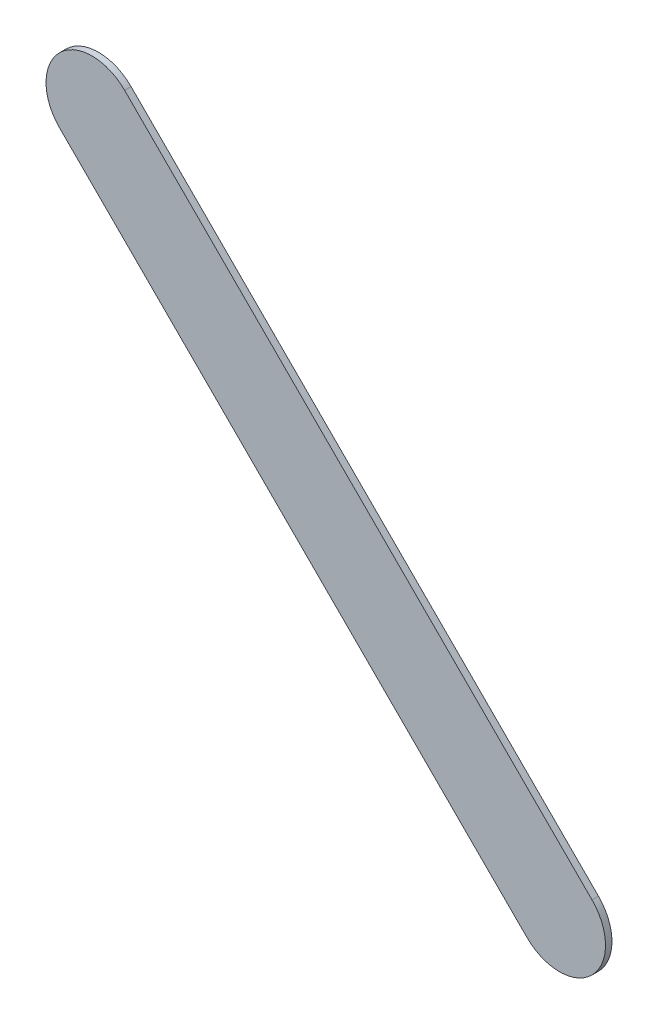
ISO-10303-21;
HEADER;
FILE_DESCRIPTION(('STEP AP214'),'2;1');
FILE_NAME('part.step','',(''),(''),'','','');
FILE_SCHEMA(('AUTOMOTIVE_DESIGN { 1 0 10303 214 1 1 1 1 }'));
ENDSEC;
DATA;
#1=APPLICATION_CONTEXT('core data for automotive mechanical design processes');
#2=APPLICATION_PROTOCOL_DEFINITION('international standard','automotive_design',2000,#1);
#3=PRODUCT_CONTEXT('',#1,'mechanical');
#4=PRODUCT('Part','Part','',(#3));
#5=PRODUCT_RELATED_PRODUCT_CATEGORY('part','',(#4));
#6=PRODUCT_DEFINITION_FORMATION('','',#4);
#7=PRODUCT_DEFINITION_CONTEXT('part definition',#1,'design');
#8=PRODUCT_DEFINITION('design','',#6,#7);
#9=PRODUCT_DEFINITION_SHAPE('','',#8);
#10=(LENGTH_UNIT() NAMED_UNIT(*) SI_UNIT(.MILLI.,.METRE.));
#11=(NAMED_UNIT(*) PLANE_ANGLE_UNIT() SI_UNIT($,.RADIAN.));
#12=(NAMED_UNIT(*) SI_UNIT($,.STERADIAN.) SOLID_ANGLE_UNIT());
#13=UNCERTAINTY_MEASURE_WITH_UNIT(LENGTH_MEASURE(1.E-05),#10,'distance_accuracy_value','');
#14=(GEOMETRIC_REPRESENTATION_CONTEXT(3) GLOBAL_UNCERTAINTY_ASSIGNED_CONTEXT((#13)) GLOBAL_UNIT_ASSIGNED_CONTEXT((#10,
#11,#12)) REPRESENTATION_CONTEXT('',''));
#15=CARTESIAN_POINT('',(0.,0.,0.));
#16=DIRECTION('',(0.,0.,1.));
#17=DIRECTION('',(1.,0.,0.));
#18=AXIS2_PLACEMENT_3D('',#15,#16,#17);
#19=CARTESIAN_POINT('',(162.736776,-85.167223,0.));
#20=DIRECTION('',(0.,0.,1.));
#21=DIRECTION('',(1.,0.,0.));
#22=AXIS2_PLACEMENT_3D('',#19,#20,#21);
#23=PLANE('',#22);
#24=DIRECTION('',(-0.707106781186548,0.707106781186548,0.));
#25=VECTOR('',#24,1.);
#26=CARTESIAN_POINT('',(162.736776,-85.167223,0.));
#27=LINE('',#26,#25);
#28=CARTESIAN_POINT('',(162.736776,-85.167223,0.));
#29=VERTEX_POINT('',#28);
#30=CARTESIAN_POINT('',(160.196776,-82.627223,0.));
#31=VERTEX_POINT('',#30);
#32=EDGE_CURVE('E98',#29,#31,#27,.T.);
#33=ORIENTED_EDGE('',*,*,#32,.T.);
#34=CARTESIAN_POINT('',(160.0199995,-82.8039995,0.));
#35=DIRECTION('',(0.,0.,1.));
#36=DIRECTION('',(0.707106781186548,0.707106781186548,0.));
#37=AXIS2_PLACEMENT_3D('',#34,#35,#36);
#38=CIRCLE('',#37,0.249999723809);
#39=CARTESIAN_POINT('',(159.843223,-82.980776,0.));
#40=VERTEX_POINT('',#39);
#41=EDGE_CURVE('E77',#31,#40,#38,.T.);
#42=ORIENTED_EDGE('',*,*,#41,.T.);
#43=DIRECTION('',(0.707106781186548,-0.707106781186548,0.));
#44=VECTOR('',#43,1.);
#45=CARTESIAN_POINT('',(159.843223,-82.980776,0.));
#46=LINE('',#45,#44);
#47=CARTESIAN_POINT('',(162.383223,-85.520776,0.));
#48=VERTEX_POINT('',#47);
#49=EDGE_CURVE('E82',#40,#48,#46,.T.);
#50=ORIENTED_EDGE('',*,*,#49,.T.);
#51=CARTESIAN_POINT('',(162.5599995,-85.3439995,0.));
#52=DIRECTION('',(0.,0.,1.));
#53=DIRECTION('',(-0.707106781186548,-0.707106781186548,0.));
#54=AXIS2_PLACEMENT_3D('',#51,#52,#53);
#55=CIRCLE('',#54,0.249999723809);
#56=EDGE_CURVE('E11',#48,#29,#55,.T.);
#57=ORIENTED_EDGE('',*,*,#56,.T.);
#58=EDGE_LOOP('',(#33,#42,#50,#57));
#59=FACE_BOUND('',#58,.T.);
#60=ADVANCED_FACE('F17',(#59),#23,.T.);
#61=CARTESIAN_POINT('',(162.736776,-85.167223,-0.035));
#62=DIRECTION('',(0.,0.,1.));
#63=DIRECTION('',(1.,0.,0.));
#64=AXIS2_PLACEMENT_3D('',#61,#62,#63);
#65=PLANE('',#64);
#66=CARTESIAN_POINT('',(162.5599995,-85.3439995,-0.035));
#67=DIRECTION('',(0.,0.,1.));
#68=DIRECTION('',(-0.707106781186548,-0.707106781186548,0.));
#69=AXIS2_PLACEMENT_3D('',#66,#67,#68);
#70=CIRCLE('',#69,0.249999723809);
#71=CARTESIAN_POINT('',(162.383223,-85.520776,-0.035));
#72=VERTEX_POINT('',#71);
#73=CARTESIAN_POINT('',(162.736776,-85.167223,-0.035));
#74=VERTEX_POINT('',#73);
#75=EDGE_CURVE('E25',#72,#74,#70,.T.);
#76=ORIENTED_EDGE('',*,*,#75,.F.);
#77=DIRECTION('',(0.707106781186548,-0.707106781186548,0.));
#78=VECTOR('',#77,1.);
#79=CARTESIAN_POINT('',(159.843223,-82.980776,-0.035));
#80=LINE('',#79,#78);
#81=CARTESIAN_POINT('',(159.843223,-82.980776,-0.035));
#82=VERTEX_POINT('',#81);
#83=EDGE_CURVE('E67',#82,#72,#80,.T.);
#84=ORIENTED_EDGE('',*,*,#83,.F.);
#85=CARTESIAN_POINT('',(160.0199995,-82.8039995,-0.035));
#86=DIRECTION('',(0.,0.,1.));
#87=DIRECTION('',(0.707106781186548,0.707106781186548,0.));
#88=AXIS2_PLACEMENT_3D('',#85,#86,#87);
#89=CIRCLE('',#88,0.249999723809);
#90=CARTESIAN_POINT('',(160.196776,-82.627223,-0.035));
#91=VERTEX_POINT('',#90);
#92=EDGE_CURVE('E71',#91,#82,#89,.T.);
#93=ORIENTED_EDGE('',*,*,#92,.F.);
#94=DIRECTION('',(-0.707106781186548,0.707106781186548,0.));
#95=VECTOR('',#94,1.);
#96=CARTESIAN_POINT('',(162.736776,-85.167223,-0.035));
#97=LINE('',#96,#95);
#98=EDGE_CURVE('E115',#74,#91,#97,.T.);
#99=ORIENTED_EDGE('',*,*,#98,.F.);
#100=EDGE_LOOP('',(#76,#84,#93,#99));
#101=FACE_BOUND('',#100,.T.);
#102=ADVANCED_FACE('F69',(#101),#65,.F.);
#103=CARTESIAN_POINT('',(162.5599995,-85.3439995,-0.035));
#104=DIRECTION('',(0.,0.,-1.));
#105=DIRECTION('',(-0.707106781186548,-0.707106781186548,0.));
#106=AXIS2_PLACEMENT_3D('',#103,#104,#105);
#107=CYLINDRICAL_SURFACE('',#106,0.249999723809);
#108=ORIENTED_EDGE('',*,*,#75,.T.);
#109=DIRECTION('',(0.,0.,1.));
#110=VECTOR('',#109,1.);
#111=CARTESIAN_POINT('',(162.736776,-85.167223,-0.035));
#112=LINE('',#111,#110);
#113=EDGE_CURVE('E92',#74,#29,#112,.T.);
#114=ORIENTED_EDGE('',*,*,#113,.T.);
#115=ORIENTED_EDGE('',*,*,#56,.F.);
#116=DIRECTION('',(0.,0.,1.));
#117=VECTOR('',#116,1.);
#118=CARTESIAN_POINT('',(162.383223,-85.520776,-0.035));
#119=LINE('',#118,#117);
#120=EDGE_CURVE('E76',#72,#48,#119,.T.);
#121=ORIENTED_EDGE('',*,*,#120,.F.);
#122=EDGE_LOOP('',(#108,#114,#115,#121));
#123=FACE_BOUND('',#122,.T.);
#124=ADVANCED_FACE('F108',(#123),#107,.T.);
#125=CARTESIAN_POINT('',(159.843223,-82.980776,-0.035));
#126=DIRECTION('',(0.707106781186548,0.707106781186548,0.));
#127=DIRECTION('',(0.,0.,-1.));
#128=AXIS2_PLACEMENT_3D('',#125,#126,#127);
#129=PLANE('',#128);
#130=ORIENTED_EDGE('',*,*,#83,.T.);
#131=ORIENTED_EDGE('',*,*,#120,.T.);
#132=ORIENTED_EDGE('',*,*,#49,.F.);
#133=DIRECTION('',(0.,0.,1.));
#134=VECTOR('',#133,1.);
#135=CARTESIAN_POINT('',(159.843223,-82.980776,-0.035));
#136=LINE('',#135,#134);
#137=EDGE_CURVE('E80',#82,#40,#136,.T.);
#138=ORIENTED_EDGE('',*,*,#137,.F.);
#139=EDGE_LOOP('',(#130,#131,#132,#138));
#140=FACE_BOUND('',#139,.T.);
#141=ADVANCED_FACE('F81',(#140),#129,.F.);
#142=CARTESIAN_POINT('',(160.0199995,-82.8039995,-0.035));
#143=DIRECTION('',(0.,0.,-1.));
#144=DIRECTION('',(0.707106781186548,0.707106781186548,0.));
#145=AXIS2_PLACEMENT_3D('',#142,#143,#144);
#146=CYLINDRICAL_SURFACE('',#145,0.249999723809);
#147=ORIENTED_EDGE('',*,*,#92,.T.);
#148=ORIENTED_EDGE('',*,*,#137,.T.);
#149=ORIENTED_EDGE('',*,*,#41,.F.);
#150=DIRECTION('',(0.,0.,1.));
#151=VECTOR('',#150,1.);
#152=CARTESIAN_POINT('',(160.196776,-82.627223,-0.035));
#153=LINE('',#152,#151);
#154=EDGE_CURVE('E89',#91,#31,#153,.T.);
#155=ORIENTED_EDGE('',*,*,#154,.F.);
#156=EDGE_LOOP('',(#147,#148,#149,#155));
#157=FACE_BOUND('',#156,.T.);
#158=ADVANCED_FACE('F87',(#157),#146,.T.);
#159=CARTESIAN_POINT('',(162.736776,-85.167223,-0.035));
#160=DIRECTION('',(-0.707106781186548,-0.707106781186548,0.));
#161=DIRECTION('',(-0.707106781186548,0.707106781186548,0.));
#162=AXIS2_PLACEMENT_3D('',#159,#160,#161);
#163=PLANE('',#162);
#164=ORIENTED_EDGE('',*,*,#98,.T.);
#165=ORIENTED_EDGE('',*,*,#154,.T.);
#166=ORIENTED_EDGE('',*,*,#32,.F.);
#167=ORIENTED_EDGE('',*,*,#113,.F.);
#168=EDGE_LOOP('',(#164,#165,#166,#167));
#169=FACE_BOUND('',#168,.T.);
#170=ADVANCED_FACE('F114',(#169),#163,.F.);
#171=CLOSED_SHELL('',(#60,#102,#124,#141,#158,#170));
#172=MANIFOLD_SOLID_BREP('B1',#171);
#173=ADVANCED_BREP_SHAPE_REPRESENTATION('',(#18,#172),#14);
#174=SHAPE_DEFINITION_REPRESENTATION(#9,#173);
ENDSEC;
END-ISO-10303-21;
